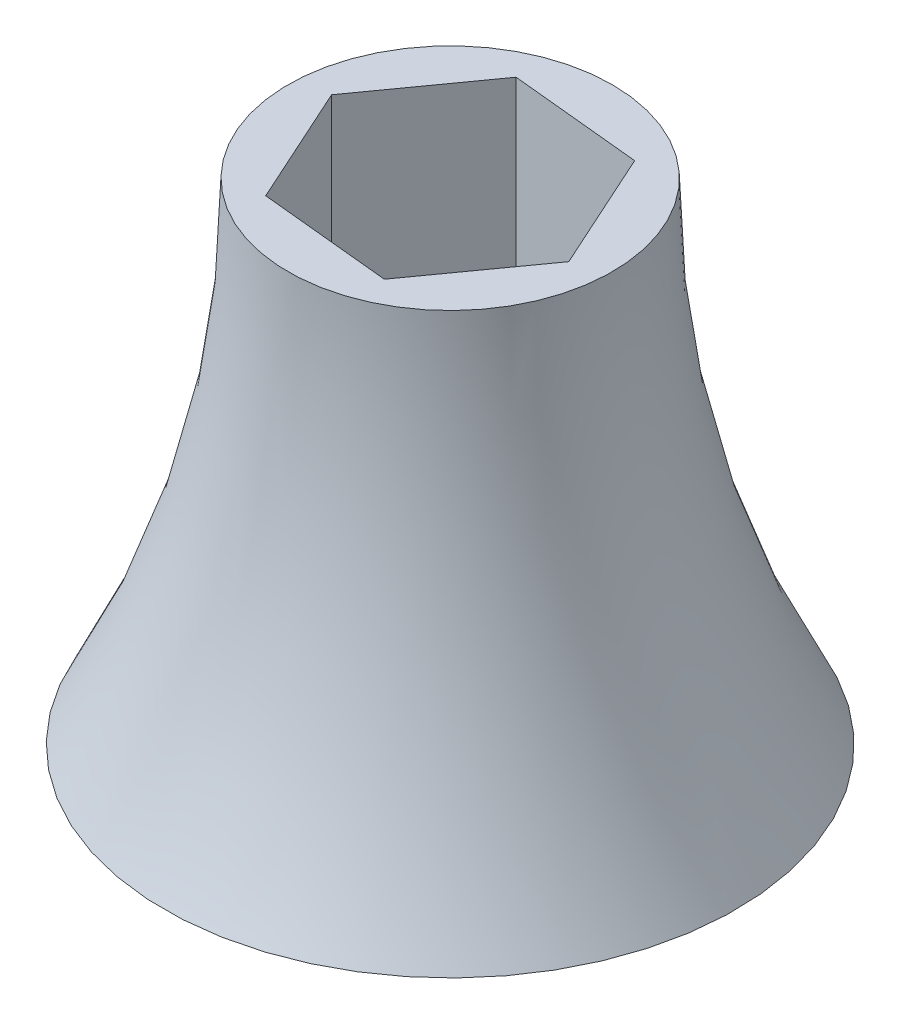
ISO-10303-21;
HEADER;
FILE_DESCRIPTION(('STEP AP214'),'2;1');
FILE_NAME('part.step','',(''),(''),'','','');
FILE_SCHEMA(('AUTOMOTIVE_DESIGN { 1 0 10303 214 1 1 1 1 }'));
ENDSEC;
DATA;
#1=APPLICATION_CONTEXT('core data for automotive mechanical design processes');
#2=APPLICATION_PROTOCOL_DEFINITION('international standard','automotive_design',2000,#1);
#3=PRODUCT_CONTEXT('',#1,'mechanical');
#4=PRODUCT('Part','Part','',(#3));
#5=PRODUCT_RELATED_PRODUCT_CATEGORY('part','',(#4));
#6=PRODUCT_DEFINITION_FORMATION('','',#4);
#7=PRODUCT_DEFINITION_CONTEXT('part definition',#1,'design');
#8=PRODUCT_DEFINITION('design','',#6,#7);
#9=PRODUCT_DEFINITION_SHAPE('','',#8);
#10=(LENGTH_UNIT() NAMED_UNIT(*) SI_UNIT(.MILLI.,.METRE.));
#11=(NAMED_UNIT(*) PLANE_ANGLE_UNIT() SI_UNIT($,.RADIAN.));
#12=(NAMED_UNIT(*) SI_UNIT($,.STERADIAN.) SOLID_ANGLE_UNIT());
#13=UNCERTAINTY_MEASURE_WITH_UNIT(LENGTH_MEASURE(1.E-05),#10,'distance_accuracy_value','');
#14=(GEOMETRIC_REPRESENTATION_CONTEXT(3) GLOBAL_UNCERTAINTY_ASSIGNED_CONTEXT((#13)) GLOBAL_UNIT_ASSIGNED_CONTEXT((#10,
#11,#12)) REPRESENTATION_CONTEXT('',''));
#15=CARTESIAN_POINT('',(0.,0.,0.));
#16=DIRECTION('',(0.,0.,1.));
#17=DIRECTION('',(1.,0.,0.));
#18=AXIS2_PLACEMENT_3D('',#15,#16,#17);
#19=CARTESIAN_POINT('',(0.,57.15,0.));
#20=DIRECTION('',(0.,1.,0.));
#21=DIRECTION('',(0.,0.,1.));
#22=AXIS2_PLACEMENT_3D('',#19,#20,#21);
#23=PLANE('',#22);
#24=DIRECTION('',(0.582558314438273,0.,-0.812788908806486));
#25=VECTOR('',#24,1.);
#26=CARTESIAN_POINT('',(-15.3236366613952,57.15,-1.510781079292));
#27=LINE('',#26,#25);
#28=CARTESIAN_POINT('',(-15.3236366613952,57.15,-1.510781079292));
#29=VERTEX_POINT('',#28);
#30=CARTESIAN_POINT('',(-6.35344353647385,57.15,-14.0260491667768));
#31=VERTEX_POINT('',#30);
#32=EDGE_CURVE('E106',#29,#31,#27,.T.);
#33=ORIENTED_EDGE('',*,*,#32,.T.);
#34=DIRECTION('',(0.995175000159787,0.,0.0981158450861447));
#35=VECTOR('',#34,1.);
#36=CARTESIAN_POINT('',(-6.35344353647385,57.15,-14.0260491667768));
#37=LINE('',#36,#35);
#38=CARTESIAN_POINT('',(8.97019312492135,57.15,-12.5152680874848));
#39=VERTEX_POINT('',#38);
#40=EDGE_CURVE('E92',#31,#39,#37,.T.);
#41=ORIENTED_EDGE('',*,*,#40,.T.);
#42=DIRECTION('',(0.412616685721513,0.,0.910904753892631));
#43=VECTOR('',#42,1.);
#44=CARTESIAN_POINT('',(8.97019312492135,57.15,-12.5152680874848));
#45=LINE('',#44,#43);
#46=CARTESIAN_POINT('',(15.3236366613952,57.15,1.510781079292));
#47=VERTEX_POINT('',#46);
#48=EDGE_CURVE('E135',#39,#47,#45,.T.);
#49=ORIENTED_EDGE('',*,*,#48,.T.);
#50=DIRECTION('',(-0.582558314438273,0.,0.812788908806486));
#51=VECTOR('',#50,1.);
#52=CARTESIAN_POINT('',(15.3236366613952,57.15,1.510781079292));
#53=LINE('',#52,#51);
#54=CARTESIAN_POINT('',(6.35344353647386,57.15,14.0260491667768));
#55=VERTEX_POINT('',#54);
#56=EDGE_CURVE('E130',#47,#55,#53,.T.);
#57=ORIENTED_EDGE('',*,*,#56,.T.);
#58=DIRECTION('',(-0.995175000159787,0.,-0.0981158450861446));
#59=VECTOR('',#58,1.);
#60=CARTESIAN_POINT('',(6.35344353647386,57.15,14.0260491667768));
#61=LINE('',#60,#59);
#62=CARTESIAN_POINT('',(-8.97019312492135,57.15,12.5152680874848));
#63=VERTEX_POINT('',#62);
#64=EDGE_CURVE('E126',#55,#63,#61,.T.);
#65=ORIENTED_EDGE('',*,*,#64,.T.);
#66=DIRECTION('',(-0.412616685721514,0.,-0.91090475389263));
#67=VECTOR('',#66,1.);
#68=CARTESIAN_POINT('',(-8.97019312492135,57.15,12.5152680874848));
#69=LINE('',#68,#67);
#70=EDGE_CURVE('E48',#63,#29,#69,.T.);
#71=ORIENTED_EDGE('',*,*,#70,.T.);
#72=EDGE_LOOP('',(#33,#41,#49,#57,#65,#71));
#73=FACE_BOUND('',#72,.T.);
#74=CARTESIAN_POINT('',(0.,57.15,0.));
#75=DIRECTION('',(0.,-1.,0.));
#76=DIRECTION('',(0.,0.,-1.));
#77=AXIS2_PLACEMENT_3D('',#74,#75,#76);
#78=CIRCLE('',#77,18.8798233698276);
#79=CARTESIAN_POINT('',(0.,57.15,-18.8798233698276));
#80=VERTEX_POINT('',#79);
#81=EDGE_CURVE('E164',#80,#80,#78,.F.);
#82=ORIENTED_EDGE('',*,*,#81,.T.);
#83=EDGE_LOOP('',(#82));
#84=FACE_BOUND('',#83,.T.);
#85=ADVANCED_FACE('F39',(#73,#84),#23,.T.);
#86=CARTESIAN_POINT('',(0.,0.,0.));
#87=DIRECTION('',(0.,1.,0.));
#88=DIRECTION('',(0.,0.,1.));
#89=AXIS2_PLACEMENT_3D('',#86,#87,#88);
#90=PLANE('',#89);
#91=DIRECTION('',(0.995175000159787,0.,0.0981158450861447));
#92=VECTOR('',#91,1.);
#93=CARTESIAN_POINT('',(-6.35344353647385,0.,-14.0260491667768));
#94=LINE('',#93,#92);
#95=CARTESIAN_POINT('',(-6.35344353647385,0.,-14.0260491667768));
#96=VERTEX_POINT('',#95);
#97=CARTESIAN_POINT('',(8.97019312492135,0.,-12.5152680874848));
#98=VERTEX_POINT('',#97);
#99=EDGE_CURVE('E152',#96,#98,#94,.T.);
#100=ORIENTED_EDGE('',*,*,#99,.F.);
#101=DIRECTION('',(0.582558314438273,0.,-0.812788908806486));
#102=VECTOR('',#101,1.);
#103=CARTESIAN_POINT('',(-15.3236366613952,0.,-1.510781079292));
#104=LINE('',#103,#102);
#105=CARTESIAN_POINT('',(-15.3236366613952,0.,-1.510781079292));
#106=VERTEX_POINT('',#105);
#107=EDGE_CURVE('E109',#106,#96,#104,.T.);
#108=ORIENTED_EDGE('',*,*,#107,.F.);
#109=DIRECTION('',(-0.412616685721513,0.,-0.91090475389263));
#110=VECTOR('',#109,1.);
#111=CARTESIAN_POINT('',(-8.97019312492135,0.,12.5152680874848));
#112=LINE('',#111,#110);
#113=CARTESIAN_POINT('',(-8.97019312492135,0.,12.5152680874848));
#114=VERTEX_POINT('',#113);
#115=EDGE_CURVE('E121',#114,#106,#112,.T.);
#116=ORIENTED_EDGE('',*,*,#115,.F.);
#117=DIRECTION('',(-0.995175000159787,0.,-0.0981158450861446));
#118=VECTOR('',#117,1.);
#119=CARTESIAN_POINT('',(6.35344353647386,0.,14.0260491667768));
#120=LINE('',#119,#118);
#121=CARTESIAN_POINT('',(6.35344353647386,0.,14.0260491667768));
#122=VERTEX_POINT('',#121);
#123=EDGE_CURVE('E61',#122,#114,#120,.T.);
#124=ORIENTED_EDGE('',*,*,#123,.F.);
#125=DIRECTION('',(-0.582558314438273,0.,0.812788908806486));
#126=VECTOR('',#125,1.);
#127=CARTESIAN_POINT('',(15.3236366613952,0.,1.510781079292));
#128=LINE('',#127,#126);
#129=CARTESIAN_POINT('',(15.3236366613952,0.,1.510781079292));
#130=VERTEX_POINT('',#129);
#131=EDGE_CURVE('E117',#130,#122,#128,.T.);
#132=ORIENTED_EDGE('',*,*,#131,.F.);
#133=DIRECTION('',(0.412616685721513,0.,0.91090475389263));
#134=VECTOR('',#133,1.);
#135=CARTESIAN_POINT('',(8.97019312492135,0.,-12.5152680874848));
#136=LINE('',#135,#134);
#137=EDGE_CURVE('E150',#98,#130,#136,.T.);
#138=ORIENTED_EDGE('',*,*,#137,.F.);
#139=EDGE_LOOP('',(#100,#108,#116,#124,#132,#138));
#140=FACE_BOUND('',#139,.T.);
#141=CARTESIAN_POINT('',(0.,0.,0.));
#142=DIRECTION('',(0.,-1.,0.));
#143=DIRECTION('',(0.,0.,-1.));
#144=AXIS2_PLACEMENT_3D('',#141,#142,#143);
#145=CIRCLE('',#144,33.274);
#146=CARTESIAN_POINT('',(0.,0.,-33.274));
#147=VERTEX_POINT('',#146);
#148=EDGE_CURVE('E168',#147,#147,#145,.F.);
#149=ORIENTED_EDGE('',*,*,#148,.F.);
#150=EDGE_LOOP('',(#149));
#151=FACE_BOUND('',#150,.T.);
#152=ADVANCED_FACE('F41',(#140,#151),#90,.F.);
#153=CARTESIAN_POINT('',(-15.3236366613952,98.6972692608935,-1.510781079292));
#154=DIRECTION('',(-0.812788908806486,0.,-0.582558314438273));
#155=DIRECTION('',(-0.582558314438273,0.,0.812788908806486));
#156=AXIS2_PLACEMENT_3D('',#153,#154,#155);
#157=PLANE('',#156);
#158=DIRECTION('',(0.,-1.,0.));
#159=VECTOR('',#158,1.);
#160=CARTESIAN_POINT('',(-15.3236366613952,98.6972692608935,-1.510781079292));
#161=LINE('',#160,#159);
#162=EDGE_CURVE('E11',#29,#106,#161,.T.);
#163=ORIENTED_EDGE('',*,*,#162,.T.);
#164=ORIENTED_EDGE('',*,*,#107,.T.);
#165=DIRECTION('',(0.,-1.,0.));
#166=VECTOR('',#165,1.);
#167=CARTESIAN_POINT('',(-6.35344353647385,98.6972692608935,-14.0260491667768));
#168=LINE('',#167,#166);
#169=EDGE_CURVE('E96',#31,#96,#168,.T.);
#170=ORIENTED_EDGE('',*,*,#169,.F.);
#171=ORIENTED_EDGE('',*,*,#32,.F.);
#172=EDGE_LOOP('',(#163,#164,#170,#171));
#173=FACE_BOUND('',#172,.T.);
#174=ADVANCED_FACE('F105',(#173),#157,.F.);
#175=CARTESIAN_POINT('',(-6.35344353647385,98.6972692608935,-14.0260491667768));
#176=DIRECTION('',(0.0981158450861447,0.,-0.995175000159787));
#177=DIRECTION('',(-0.995175000159787,0.,-0.0981158450861447));
#178=AXIS2_PLACEMENT_3D('',#175,#176,#177);
#179=PLANE('',#178);
#180=ORIENTED_EDGE('',*,*,#169,.T.);
#181=ORIENTED_EDGE('',*,*,#99,.T.);
#182=DIRECTION('',(0.,-1.,0.));
#183=VECTOR('',#182,1.);
#184=CARTESIAN_POINT('',(8.97019312492135,98.6972692608935,-12.5152680874848));
#185=LINE('',#184,#183);
#186=EDGE_CURVE('E98',#39,#98,#185,.T.);
#187=ORIENTED_EDGE('',*,*,#186,.F.);
#188=ORIENTED_EDGE('',*,*,#40,.F.);
#189=EDGE_LOOP('',(#180,#181,#187,#188));
#190=FACE_BOUND('',#189,.T.);
#191=ADVANCED_FACE('F94',(#190),#179,.F.);
#192=CARTESIAN_POINT('',(8.97019312492135,98.6972692608935,-12.5152680874848));
#193=DIRECTION('',(0.91090475389263,0.,-0.412616685721513));
#194=DIRECTION('',(-0.412616685721513,0.,-0.910904753892631));
#195=AXIS2_PLACEMENT_3D('',#192,#193,#194);
#196=PLANE('',#195);
#197=ORIENTED_EDGE('',*,*,#186,.T.);
#198=ORIENTED_EDGE('',*,*,#137,.T.);
#199=DIRECTION('',(0.,-1.,0.));
#200=VECTOR('',#199,1.);
#201=CARTESIAN_POINT('',(15.3236366613952,98.6972692608935,1.510781079292));
#202=LINE('',#201,#200);
#203=EDGE_CURVE('E134',#47,#130,#202,.T.);
#204=ORIENTED_EDGE('',*,*,#203,.F.);
#205=ORIENTED_EDGE('',*,*,#48,.F.);
#206=EDGE_LOOP('',(#197,#198,#204,#205));
#207=FACE_BOUND('',#206,.T.);
#208=ADVANCED_FACE('F147',(#207),#196,.F.);
#209=CARTESIAN_POINT('',(15.3236366613952,98.6972692608935,1.510781079292));
#210=DIRECTION('',(0.812788908806486,0.,0.582558314438273));
#211=DIRECTION('',(0.582558314438273,0.,-0.812788908806486));
#212=AXIS2_PLACEMENT_3D('',#209,#210,#211);
#213=PLANE('',#212);
#214=ORIENTED_EDGE('',*,*,#203,.T.);
#215=ORIENTED_EDGE('',*,*,#131,.T.);
#216=DIRECTION('',(0.,-1.,0.));
#217=VECTOR('',#216,1.);
#218=CARTESIAN_POINT('',(6.35344353647386,98.6972692608935,14.0260491667768));
#219=LINE('',#218,#217);
#220=EDGE_CURVE('E129',#55,#122,#219,.T.);
#221=ORIENTED_EDGE('',*,*,#220,.F.);
#222=ORIENTED_EDGE('',*,*,#56,.F.);
#223=EDGE_LOOP('',(#214,#215,#221,#222));
#224=FACE_BOUND('',#223,.T.);
#225=ADVANCED_FACE('F190',(#224),#213,.F.);
#226=CARTESIAN_POINT('',(6.35344353647386,98.6972692608935,14.0260491667768));
#227=DIRECTION('',(-0.0981158450861446,0.,0.995175000159787));
#228=DIRECTION('',(0.995175000159787,0.,0.0981158450861446));
#229=AXIS2_PLACEMENT_3D('',#226,#227,#228);
#230=PLANE('',#229);
#231=ORIENTED_EDGE('',*,*,#220,.T.);
#232=ORIENTED_EDGE('',*,*,#123,.T.);
#233=DIRECTION('',(0.,-1.,0.));
#234=VECTOR('',#233,1.);
#235=CARTESIAN_POINT('',(-8.97019312492135,98.6972692608935,12.5152680874848));
#236=LINE('',#235,#234);
#237=EDGE_CURVE('E125',#63,#114,#236,.T.);
#238=ORIENTED_EDGE('',*,*,#237,.F.);
#239=ORIENTED_EDGE('',*,*,#64,.F.);
#240=EDGE_LOOP('',(#231,#232,#238,#239));
#241=FACE_BOUND('',#240,.T.);
#242=ADVANCED_FACE('F193',(#241),#230,.F.);
#243=CARTESIAN_POINT('',(-8.97019312492135,98.6972692608935,12.5152680874848));
#244=DIRECTION('',(-0.91090475389263,0.,0.412616685721514));
#245=DIRECTION('',(0.412616685721514,0.,0.91090475389263));
#246=AXIS2_PLACEMENT_3D('',#243,#244,#245);
#247=PLANE('',#246);
#248=ORIENTED_EDGE('',*,*,#237,.T.);
#249=ORIENTED_EDGE('',*,*,#115,.T.);
#250=ORIENTED_EDGE('',*,*,#162,.F.);
#251=ORIENTED_EDGE('',*,*,#70,.F.);
#252=EDGE_LOOP('',(#248,#249,#250,#251));
#253=FACE_BOUND('',#252,.T.);
#254=ADVANCED_FACE('F197',(#253),#247,.F.);
#255=CARTESIAN_POINT('',(0.,57.15,0.));
#256=DIRECTION('',(0.,-1.,0.));
#257=DIRECTION('',(0.,0.,-1.));
#258=AXIS2_PLACEMENT_3D('',#255,#256,#257);
#259=TOROIDAL_SURFACE('',#258,139.529823369828,120.65);
#260=ORIENTED_EDGE('',*,*,#81,.F.);
#261=EDGE_LOOP('',(#260));
#262=FACE_BOUND('',#261,.T.);
#263=ORIENTED_EDGE('',*,*,#148,.T.);
#264=EDGE_LOOP('',(#263));
#265=FACE_BOUND('',#264,.T.);
#266=ADVANCED_FACE('F176',(#262,#265),#259,.F.);
#267=CLOSED_SHELL('',(#85,#152,#174,#191,#208,#225,#242,#254,#266));
#268=MANIFOLD_SOLID_BREP('B2',#267);
#269=ADVANCED_BREP_SHAPE_REPRESENTATION('',(#18,#268),#14);
#270=SHAPE_DEFINITION_REPRESENTATION(#9,#269);
ENDSEC;
END-ISO-10303-21;
